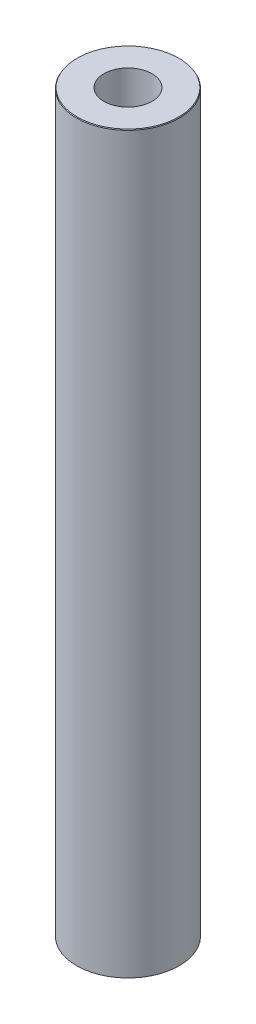
ISO-10303-21;
HEADER;
FILE_DESCRIPTION(('STEP AP214'),'2;1');
FILE_NAME('part.step','',(''),(''),'','','');
FILE_SCHEMA(('AUTOMOTIVE_DESIGN { 1 0 10303 214 1 1 1 1 }'));
ENDSEC;
DATA;
#1=APPLICATION_CONTEXT('core data for automotive mechanical design processes');
#2=APPLICATION_PROTOCOL_DEFINITION('international standard','automotive_design',2000,#1);
#3=PRODUCT_CONTEXT('',#1,'mechanical');
#4=PRODUCT('Part','Part','',(#3));
#5=PRODUCT_RELATED_PRODUCT_CATEGORY('part','',(#4));
#6=PRODUCT_DEFINITION_FORMATION('','',#4);
#7=PRODUCT_DEFINITION_CONTEXT('part definition',#1,'design');
#8=PRODUCT_DEFINITION('design','',#6,#7);
#9=PRODUCT_DEFINITION_SHAPE('','',#8);
#10=(LENGTH_UNIT() NAMED_UNIT(*) SI_UNIT(.MILLI.,.METRE.));
#11=(NAMED_UNIT(*) PLANE_ANGLE_UNIT() SI_UNIT($,.RADIAN.));
#12=(NAMED_UNIT(*) SI_UNIT($,.STERADIAN.) SOLID_ANGLE_UNIT());
#13=UNCERTAINTY_MEASURE_WITH_UNIT(LENGTH_MEASURE(1.E-05),#10,'distance_accuracy_value','');
#14=(GEOMETRIC_REPRESENTATION_CONTEXT(3) GLOBAL_UNCERTAINTY_ASSIGNED_CONTEXT((#13)) GLOBAL_UNIT_ASSIGNED_CONTEXT((#10,
#11,#12)) REPRESENTATION_CONTEXT('',''));
#15=CARTESIAN_POINT('',(0.,0.,0.));
#16=DIRECTION('',(0.,0.,1.));
#17=DIRECTION('',(1.,0.,0.));
#18=AXIS2_PLACEMENT_3D('',#15,#16,#17);
#19=CARTESIAN_POINT('',(0.,501.193904650899,0.));
#20=DIRECTION('',(0.,-1.,0.));
#21=DIRECTION('',(0.,0.,-1.));
#22=AXIS2_PLACEMENT_3D('',#19,#20,#21);
#23=CYLINDRICAL_SURFACE('',#22,35.);
#24=CARTESIAN_POINT('',(0.,500.637307765835,0.));
#25=DIRECTION('',(0.,1.,0.));
#26=DIRECTION('',(0.,0.,1.));
#27=AXIS2_PLACEMENT_3D('',#24,#25,#26);
#28=CIRCLE('',#27,35.);
#29=CARTESIAN_POINT('',(0.,500.637307765835,35.));
#30=VERTEX_POINT('',#29);
#31=EDGE_CURVE('E50',#30,#30,#28,.F.);
#32=ORIENTED_EDGE('',*,*,#31,.T.);
#33=EDGE_LOOP('',(#32));
#34=FACE_BOUND('',#33,.T.);
#35=CARTESIAN_POINT('',(0.,0.321351361421418,0.));
#36=DIRECTION('',(0.,1.,0.));
#37=DIRECTION('',(0.,0.,1.));
#38=AXIS2_PLACEMENT_3D('',#35,#36,#37);
#39=CIRCLE('',#38,35.);
#40=CARTESIAN_POINT('',(0.,0.321351361421418,35.));
#41=VERTEX_POINT('',#40);
#42=EDGE_CURVE('E51',#41,#41,#39,.T.);
#43=ORIENTED_EDGE('',*,*,#42,.T.);
#44=EDGE_LOOP('',(#43));
#45=FACE_BOUND('',#44,.T.);
#46=ADVANCED_FACE('F39',(#34,#45),#23,.T.);
#47=CARTESIAN_POINT('',(0.,501.193904650899,0.));
#48=DIRECTION('',(0.,1.,0.));
#49=DIRECTION('',(0.,0.,1.));
#50=AXIS2_PLACEMENT_3D('',#47,#48,#49);
#51=PLANE('',#50);
#52=CARTESIAN_POINT('',(0.,501.193904650899,0.));
#53=DIRECTION('',(0.,1.,0.));
#54=DIRECTION('',(0.,0.,1.));
#55=AXIS2_PLACEMENT_3D('',#52,#53,#54);
#56=CIRCLE('',#55,34.6786486385786);
#57=CARTESIAN_POINT('',(0.,501.193904650899,34.6786486385786));
#58=VERTEX_POINT('',#57);
#59=EDGE_CURVE('E54',#58,#58,#56,.T.);
#60=ORIENTED_EDGE('',*,*,#59,.T.);
#61=EDGE_LOOP('',(#60));
#62=FACE_BOUND('',#61,.T.);
#63=CARTESIAN_POINT('',(0.,501.193904650899,0.));
#64=DIRECTION('',(0.,1.,0.));
#65=DIRECTION('',(0.,0.,1.));
#66=AXIS2_PLACEMENT_3D('',#63,#64,#65);
#67=CIRCLE('',#66,16.3826832099784);
#68=CARTESIAN_POINT('',(0.,501.193904650899,16.3826832099784));
#69=VERTEX_POINT('',#68);
#70=EDGE_CURVE('E58',#69,#69,#67,.T.);
#71=ORIENTED_EDGE('',*,*,#70,.F.);
#72=EDGE_LOOP('',(#71));
#73=FACE_BOUND('',#72,.T.);
#74=ADVANCED_FACE('F69',(#62,#73),#51,.T.);
#75=CARTESIAN_POINT('',(0.,0.,0.));
#76=DIRECTION('',(0.,1.,0.));
#77=DIRECTION('',(0.,0.,1.));
#78=AXIS2_PLACEMENT_3D('',#75,#76,#77);
#79=PLANE('',#78);
#80=CARTESIAN_POINT('',(0.,0.,0.));
#81=DIRECTION('',(0.,1.,0.));
#82=DIRECTION('',(0.,0.,1.));
#83=AXIS2_PLACEMENT_3D('',#80,#81,#82);
#84=CIRCLE('',#83,34.4434031149366);
#85=CARTESIAN_POINT('',(0.,0.,34.4434031149366));
#86=VERTEX_POINT('',#85);
#87=EDGE_CURVE('E10',#86,#86,#84,.F.);
#88=ORIENTED_EDGE('',*,*,#87,.T.);
#89=EDGE_LOOP('',(#88));
#90=FACE_BOUND('',#89,.T.);
#91=CARTESIAN_POINT('',(0.,0.,0.));
#92=DIRECTION('',(0.,1.,0.));
#93=DIRECTION('',(0.,0.,1.));
#94=AXIS2_PLACEMENT_3D('',#91,#92,#93);
#95=CIRCLE('',#94,16.3826832099784);
#96=CARTESIAN_POINT('',(0.,0.,16.3826832099784));
#97=VERTEX_POINT('',#96);
#98=EDGE_CURVE('E63',#97,#97,#95,.T.);
#99=ORIENTED_EDGE('',*,*,#98,.T.);
#100=EDGE_LOOP('',(#99));
#101=FACE_BOUND('',#100,.T.);
#102=ADVANCED_FACE('F75',(#90,#101),#79,.F.);
#103=CARTESIAN_POINT('',(0.,501.193904650899,0.));
#104=DIRECTION('',(0.,-1.,0.));
#105=DIRECTION('',(0.,0.,-1.));
#106=AXIS2_PLACEMENT_3D('',#103,#104,#105);
#107=CYLINDRICAL_SURFACE('',#106,16.3826832099784);
#108=ORIENTED_EDGE('',*,*,#70,.T.);
#109=EDGE_LOOP('',(#108));
#110=FACE_BOUND('',#109,.T.);
#111=ORIENTED_EDGE('',*,*,#98,.F.);
#112=EDGE_LOOP('',(#111));
#113=FACE_BOUND('',#112,.T.);
#114=ADVANCED_FACE('F70',(#110,#113),#107,.F.);
#115=CARTESIAN_POINT('',(0.,501.193904650899,0.));
#116=DIRECTION('',(0.,-1.,0.));
#117=DIRECTION('',(0.,0.,-1.));
#118=AXIS2_PLACEMENT_3D('',#115,#116,#117);
#119=CONICAL_SURFACE('',#118,34.6786486385786,0.523598775598133);
#120=ORIENTED_EDGE('',*,*,#31,.F.);
#121=EDGE_LOOP('',(#120));
#122=FACE_BOUND('',#121,.T.);
#123=ORIENTED_EDGE('',*,*,#59,.F.);
#124=EDGE_LOOP('',(#123));
#125=FACE_BOUND('',#124,.T.);
#126=ADVANCED_FACE('F81',(#122,#125),#119,.T.);
#127=CARTESIAN_POINT('',(0.,0.321351361421418,0.));
#128=DIRECTION('',(0.,1.,0.));
#129=DIRECTION('',(0.,0.,1.));
#130=AXIS2_PLACEMENT_3D('',#127,#128,#129);
#131=CONICAL_SURFACE('',#130,35.,1.04719755119666);
#132=ORIENTED_EDGE('',*,*,#87,.F.);
#133=EDGE_LOOP('',(#132));
#134=FACE_BOUND('',#133,.T.);
#135=ORIENTED_EDGE('',*,*,#42,.F.);
#136=EDGE_LOOP('',(#135));
#137=FACE_BOUND('',#136,.T.);
#138=ADVANCED_FACE('F45',(#134,#137),#131,.T.);
#139=CLOSED_SHELL('',(#46,#74,#102,#114,#126,#138));
#140=MANIFOLD_SOLID_BREP('B2',#139);
#141=ADVANCED_BREP_SHAPE_REPRESENTATION('',(#18,#140),#14);
#142=SHAPE_DEFINITION_REPRESENTATION(#9,#141);
ENDSEC;
END-ISO-10303-21;
